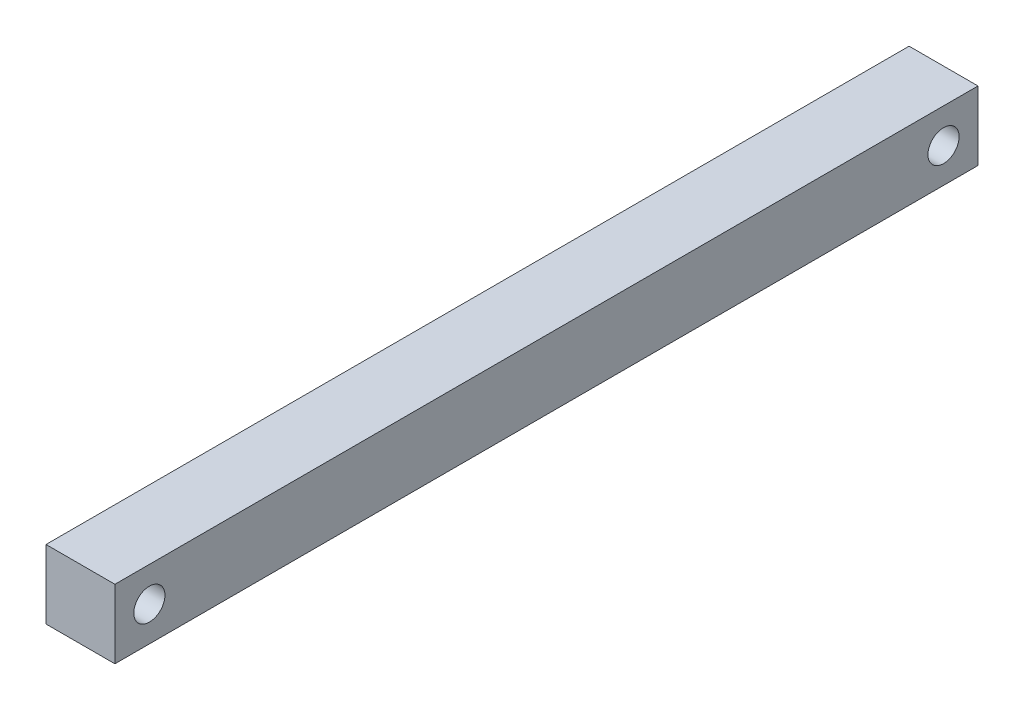
ISO-10303-21;
HEADER;
FILE_DESCRIPTION(('STEP AP214'),'2;1');
FILE_NAME('part.step','',(''),(''),'','','');
FILE_SCHEMA(('AUTOMOTIVE_DESIGN { 1 0 10303 214 1 1 1 1 }'));
ENDSEC;
DATA;
#1=APPLICATION_CONTEXT('core data for automotive mechanical design processes');
#2=APPLICATION_PROTOCOL_DEFINITION('international standard','automotive_design',2000,#1);
#3=PRODUCT_CONTEXT('',#1,'mechanical');
#4=PRODUCT('Part','Part','',(#3));
#5=PRODUCT_RELATED_PRODUCT_CATEGORY('part','',(#4));
#6=PRODUCT_DEFINITION_FORMATION('','',#4);
#7=PRODUCT_DEFINITION_CONTEXT('part definition',#1,'design');
#8=PRODUCT_DEFINITION('design','',#6,#7);
#9=PRODUCT_DEFINITION_SHAPE('','',#8);
#10=(LENGTH_UNIT() NAMED_UNIT(*) SI_UNIT(.MILLI.,.METRE.));
#11=(NAMED_UNIT(*) PLANE_ANGLE_UNIT() SI_UNIT($,.RADIAN.));
#12=(NAMED_UNIT(*) SI_UNIT($,.STERADIAN.) SOLID_ANGLE_UNIT());
#13=UNCERTAINTY_MEASURE_WITH_UNIT(LENGTH_MEASURE(1.E-05),#10,'distance_accuracy_value','');
#14=(GEOMETRIC_REPRESENTATION_CONTEXT(3) GLOBAL_UNCERTAINTY_ASSIGNED_CONTEXT((#13)) GLOBAL_UNIT_ASSIGNED_CONTEXT((#10,
#11,#12)) REPRESENTATION_CONTEXT('',''));
#15=CARTESIAN_POINT('',(0.,0.,0.));
#16=DIRECTION('',(0.,0.,1.));
#17=DIRECTION('',(1.,0.,0.));
#18=AXIS2_PLACEMENT_3D('',#15,#16,#17);
#19=CARTESIAN_POINT('',(4.7625,-4.7625,119.297492000501));
#20=DIRECTION('',(-1.,0.,0.));
#21=DIRECTION('',(0.,0.,1.));
#22=AXIS2_PLACEMENT_3D('',#19,#20,#21);
#23=PLANE('',#22);
#24=CARTESIAN_POINT('',(4.7625,0.,114.534992000501));
#25=DIRECTION('',(-1.,0.,0.));
#26=DIRECTION('',(0.,0.,1.));
#27=AXIS2_PLACEMENT_3D('',#24,#25,#26);
#28=CIRCLE('',#27,2.15265);
#29=CARTESIAN_POINT('',(4.7625,0.,116.687642000501));
#30=VERTEX_POINT('',#29);
#31=EDGE_CURVE('E122',#30,#30,#28,.T.);
#32=ORIENTED_EDGE('',*,*,#31,.T.);
#33=EDGE_LOOP('',(#32));
#34=FACE_BOUND('',#33,.T.);
#35=CARTESIAN_POINT('',(4.7625,0.,4.7625));
#36=DIRECTION('',(1.,0.,0.));
#37=DIRECTION('',(0.,0.,-1.));
#38=AXIS2_PLACEMENT_3D('',#35,#36,#37);
#39=CIRCLE('',#38,2.15265);
#40=CARTESIAN_POINT('',(4.7625,0.,2.60985));
#41=VERTEX_POINT('',#40);
#42=EDGE_CURVE('E116',#41,#41,#39,.T.);
#43=ORIENTED_EDGE('',*,*,#42,.F.);
#44=EDGE_LOOP('',(#43));
#45=FACE_BOUND('',#44,.T.);
#46=DIRECTION('',(0.,1.,0.));
#47=VECTOR('',#46,1.);
#48=CARTESIAN_POINT('',(4.7625,-4.7625,0.));
#49=LINE('',#48,#47);
#50=CARTESIAN_POINT('',(4.7625,-4.7625,0.));
#51=VERTEX_POINT('',#50);
#52=CARTESIAN_POINT('',(4.7625,4.7625,0.));
#53=VERTEX_POINT('',#52);
#54=EDGE_CURVE('E102',#51,#53,#49,.T.);
#55=ORIENTED_EDGE('',*,*,#54,.T.);
#56=DIRECTION('',(0.,0.,-1.));
#57=VECTOR('',#56,1.);
#58=CARTESIAN_POINT('',(4.7625,4.7625,119.297492000501));
#59=LINE('',#58,#57);
#60=CARTESIAN_POINT('',(4.7625,4.7625,119.297492000501));
#61=VERTEX_POINT('',#60);
#62=EDGE_CURVE('E11',#61,#53,#59,.T.);
#63=ORIENTED_EDGE('',*,*,#62,.F.);
#64=DIRECTION('',(0.,1.,0.));
#65=VECTOR('',#64,1.);
#66=CARTESIAN_POINT('',(4.7625,-4.7625,119.297492000501));
#67=LINE('',#66,#65);
#68=CARTESIAN_POINT('',(4.7625,-4.7625,119.297492000501));
#69=VERTEX_POINT('',#68);
#70=EDGE_CURVE('E90',#69,#61,#67,.T.);
#71=ORIENTED_EDGE('',*,*,#70,.F.);
#72=DIRECTION('',(0.,0.,-1.));
#73=VECTOR('',#72,1.);
#74=CARTESIAN_POINT('',(4.7625,-4.7625,119.297492000501));
#75=LINE('',#74,#73);
#76=EDGE_CURVE('E98',#69,#51,#75,.T.);
#77=ORIENTED_EDGE('',*,*,#76,.T.);
#78=EDGE_LOOP('',(#55,#63,#71,#77));
#79=FACE_BOUND('',#78,.T.);
#80=ADVANCED_FACE('F39',(#34,#45,#79),#23,.F.);
#81=CARTESIAN_POINT('',(-4.7625,4.7625,119.297492000501));
#82=DIRECTION('',(0.,-1.,0.));
#83=DIRECTION('',(0.,0.,-1.));
#84=AXIS2_PLACEMENT_3D('',#81,#82,#83);
#85=PLANE('',#84);
#86=DIRECTION('',(-1.,0.,0.));
#87=VECTOR('',#86,1.);
#88=CARTESIAN_POINT('',(-4.7625,4.7625,0.));
#89=LINE('',#88,#87);
#90=CARTESIAN_POINT('',(-4.7625,4.7625,0.));
#91=VERTEX_POINT('',#90);
#92=EDGE_CURVE('E94',#53,#91,#89,.T.);
#93=ORIENTED_EDGE('',*,*,#92,.T.);
#94=DIRECTION('',(0.,0.,-1.));
#95=VECTOR('',#94,1.);
#96=CARTESIAN_POINT('',(-4.7625,4.7625,119.297492000501));
#97=LINE('',#96,#95);
#98=CARTESIAN_POINT('',(-4.7625,4.7625,119.297492000501));
#99=VERTEX_POINT('',#98);
#100=EDGE_CURVE('E47',#99,#91,#97,.T.);
#101=ORIENTED_EDGE('',*,*,#100,.F.);
#102=DIRECTION('',(-1.,0.,0.));
#103=VECTOR('',#102,1.);
#104=CARTESIAN_POINT('',(-4.7625,4.7625,119.297492000501));
#105=LINE('',#104,#103);
#106=EDGE_CURVE('E85',#61,#99,#105,.T.);
#107=ORIENTED_EDGE('',*,*,#106,.F.);
#108=ORIENTED_EDGE('',*,*,#62,.T.);
#109=EDGE_LOOP('',(#93,#101,#107,#108));
#110=FACE_BOUND('',#109,.T.);
#111=ADVANCED_FACE('F93',(#110),#85,.F.);
#112=CARTESIAN_POINT('',(-4.7625,-4.7625,119.297492000501));
#113=DIRECTION('',(1.,0.,0.));
#114=DIRECTION('',(0.,0.,-1.));
#115=AXIS2_PLACEMENT_3D('',#112,#113,#114);
#116=PLANE('',#115);
#117=CARTESIAN_POINT('',(-4.7625,0.,114.534992000501));
#118=DIRECTION('',(-1.,0.,0.));
#119=DIRECTION('',(0.,0.,1.));
#120=AXIS2_PLACEMENT_3D('',#117,#118,#119);
#121=CIRCLE('',#120,2.15265);
#122=CARTESIAN_POINT('',(-4.7625,0.,116.687642000501));
#123=VERTEX_POINT('',#122);
#124=EDGE_CURVE('E119',#123,#123,#121,.T.);
#125=ORIENTED_EDGE('',*,*,#124,.F.);
#126=EDGE_LOOP('',(#125));
#127=FACE_BOUND('',#126,.T.);
#128=CARTESIAN_POINT('',(-4.7625,0.,4.7625));
#129=DIRECTION('',(1.,0.,0.));
#130=DIRECTION('',(0.,0.,-1.));
#131=AXIS2_PLACEMENT_3D('',#128,#129,#130);
#132=CIRCLE('',#131,2.15265);
#133=CARTESIAN_POINT('',(-4.7625,0.,2.60985));
#134=VERTEX_POINT('',#133);
#135=EDGE_CURVE('E105',#134,#134,#132,.T.);
#136=ORIENTED_EDGE('',*,*,#135,.T.);
#137=EDGE_LOOP('',(#136));
#138=FACE_BOUND('',#137,.T.);
#139=DIRECTION('',(0.,-1.,0.));
#140=VECTOR('',#139,1.);
#141=CARTESIAN_POINT('',(-4.7625,-4.7625,0.));
#142=LINE('',#141,#140);
#143=CARTESIAN_POINT('',(-4.7625,-4.7625,0.));
#144=VERTEX_POINT('',#143);
#145=EDGE_CURVE('E72',#91,#144,#142,.T.);
#146=ORIENTED_EDGE('',*,*,#145,.T.);
#147=DIRECTION('',(0.,0.,-1.));
#148=VECTOR('',#147,1.);
#149=CARTESIAN_POINT('',(-4.7625,-4.7625,119.297492000501));
#150=LINE('',#149,#148);
#151=CARTESIAN_POINT('',(-4.7625,-4.7625,119.297492000501));
#152=VERTEX_POINT('',#151);
#153=EDGE_CURVE('E95',#152,#144,#150,.T.);
#154=ORIENTED_EDGE('',*,*,#153,.F.);
#155=DIRECTION('',(0.,-1.,0.));
#156=VECTOR('',#155,1.);
#157=CARTESIAN_POINT('',(-4.7625,-4.7625,119.297492000501));
#158=LINE('',#157,#156);
#159=EDGE_CURVE('E88',#99,#152,#158,.T.);
#160=ORIENTED_EDGE('',*,*,#159,.F.);
#161=ORIENTED_EDGE('',*,*,#100,.T.);
#162=EDGE_LOOP('',(#146,#154,#160,#161));
#163=FACE_BOUND('',#162,.T.);
#164=ADVANCED_FACE('F96',(#127,#138,#163),#116,.F.);
#165=CARTESIAN_POINT('',(-4.7625,-4.7625,119.297492000501));
#166=DIRECTION('',(0.,1.,0.));
#167=DIRECTION('',(0.,0.,1.));
#168=AXIS2_PLACEMENT_3D('',#165,#166,#167);
#169=PLANE('',#168);
#170=DIRECTION('',(1.,0.,0.));
#171=VECTOR('',#170,1.);
#172=CARTESIAN_POINT('',(-4.7625,-4.7625,0.));
#173=LINE('',#172,#171);
#174=EDGE_CURVE('E78',#144,#51,#173,.T.);
#175=ORIENTED_EDGE('',*,*,#174,.T.);
#176=ORIENTED_EDGE('',*,*,#76,.F.);
#177=DIRECTION('',(1.,0.,0.));
#178=VECTOR('',#177,1.);
#179=CARTESIAN_POINT('',(-4.7625,-4.7625,119.297492000501));
#180=LINE('',#179,#178);
#181=EDGE_CURVE('E55',#152,#69,#180,.T.);
#182=ORIENTED_EDGE('',*,*,#181,.F.);
#183=ORIENTED_EDGE('',*,*,#153,.T.);
#184=EDGE_LOOP('',(#175,#176,#182,#183));
#185=FACE_BOUND('',#184,.T.);
#186=ADVANCED_FACE('F110',(#185),#169,.F.);
#187=CARTESIAN_POINT('',(0.,0.,119.297492000501));
#188=DIRECTION('',(0.,0.,-1.));
#189=DIRECTION('',(-1.,0.,0.));
#190=AXIS2_PLACEMENT_3D('',#187,#188,#189);
#191=PLANE('',#190);
#192=ORIENTED_EDGE('',*,*,#70,.T.);
#193=ORIENTED_EDGE('',*,*,#106,.T.);
#194=ORIENTED_EDGE('',*,*,#159,.T.);
#195=ORIENTED_EDGE('',*,*,#181,.T.);
#196=EDGE_LOOP('',(#192,#193,#194,#195));
#197=FACE_BOUND('',#196,.T.);
#198=ADVANCED_FACE('F86',(#197),#191,.F.);
#199=CARTESIAN_POINT('',(0.,0.,0.));
#200=DIRECTION('',(0.,0.,-1.));
#201=DIRECTION('',(-1.,0.,0.));
#202=AXIS2_PLACEMENT_3D('',#199,#200,#201);
#203=PLANE('',#202);
#204=ORIENTED_EDGE('',*,*,#54,.F.);
#205=ORIENTED_EDGE('',*,*,#174,.F.);
#206=ORIENTED_EDGE('',*,*,#145,.F.);
#207=ORIENTED_EDGE('',*,*,#92,.F.);
#208=EDGE_LOOP('',(#204,#205,#206,#207));
#209=FACE_BOUND('',#208,.T.);
#210=ADVANCED_FACE('F113',(#209),#203,.T.);
#211=CARTESIAN_POINT('',(-4.7625,0.,4.7625));
#212=DIRECTION('',(1.,0.,0.));
#213=DIRECTION('',(0.,0.,-1.));
#214=AXIS2_PLACEMENT_3D('',#211,#212,#213);
#215=CYLINDRICAL_SURFACE('',#214,2.15265);
#216=ORIENTED_EDGE('',*,*,#135,.F.);
#217=EDGE_LOOP('',(#216));
#218=FACE_BOUND('',#217,.T.);
#219=ORIENTED_EDGE('',*,*,#42,.T.);
#220=EDGE_LOOP('',(#219));
#221=FACE_BOUND('',#220,.T.);
#222=ADVANCED_FACE('F136',(#218,#221),#215,.F.);
#223=CARTESIAN_POINT('',(-4.7625,0.,114.534992000501));
#224=DIRECTION('',(1.,0.,0.));
#225=DIRECTION('',(0.,0.,-1.));
#226=AXIS2_PLACEMENT_3D('',#223,#224,#225);
#227=CYLINDRICAL_SURFACE('',#226,2.15265);
#228=ORIENTED_EDGE('',*,*,#124,.T.);
#229=EDGE_LOOP('',(#228));
#230=FACE_BOUND('',#229,.T.);
#231=ORIENTED_EDGE('',*,*,#31,.F.);
#232=EDGE_LOOP('',(#231));
#233=FACE_BOUND('',#232,.T.);
#234=ADVANCED_FACE('F128',(#230,#233),#227,.F.);
#235=CLOSED_SHELL('',(#80,#111,#164,#186,#198,#210,#222,#234));
#236=MANIFOLD_SOLID_BREP('B2',#235);
#237=ADVANCED_BREP_SHAPE_REPRESENTATION('',(#18,#236),#14);
#238=SHAPE_DEFINITION_REPRESENTATION(#9,#237);
ENDSEC;
END-ISO-10303-21;
